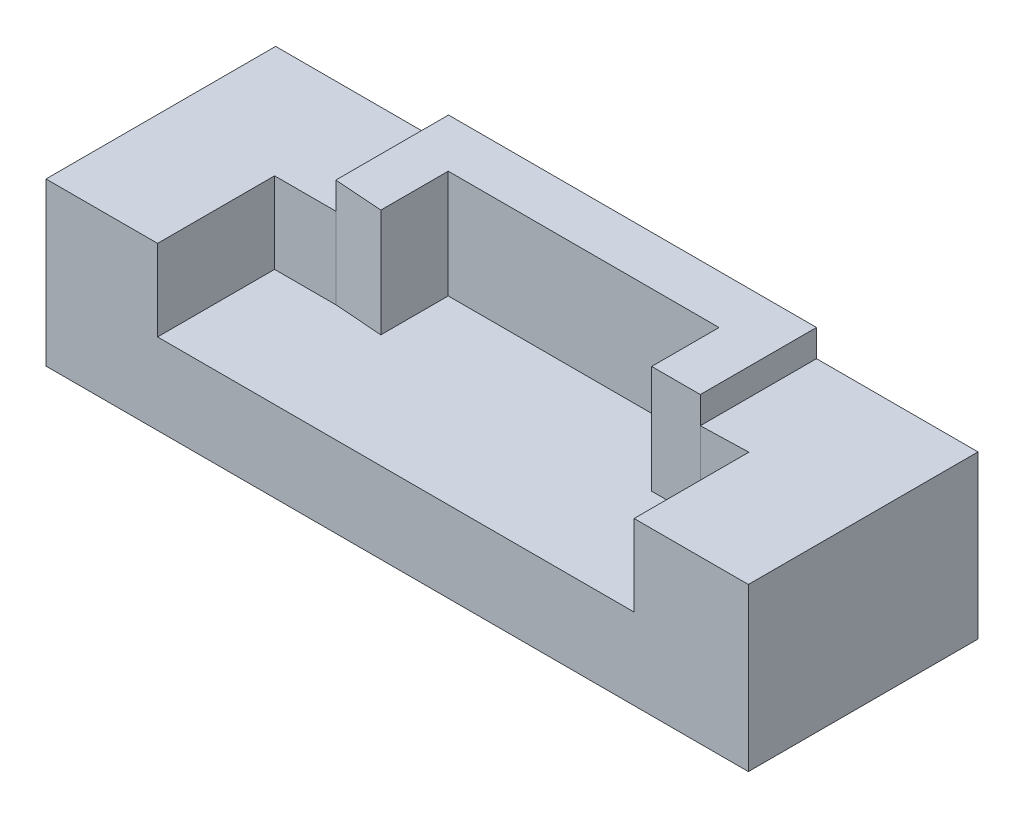
ISO-10303-21;
HEADER;
FILE_DESCRIPTION(('STEP AP214'),'2;1');
FILE_NAME('part.step','',(''),(''),'','','');
FILE_SCHEMA(('AUTOMOTIVE_DESIGN { 1 0 10303 214 1 1 1 1 }'));
ENDSEC;
DATA;
#1=APPLICATION_CONTEXT('core data for automotive mechanical design processes');
#2=APPLICATION_PROTOCOL_DEFINITION('international standard','automotive_design',2000,#1);
#3=PRODUCT_CONTEXT('',#1,'mechanical');
#4=PRODUCT('Part','Part','',(#3));
#5=PRODUCT_RELATED_PRODUCT_CATEGORY('part','',(#4));
#6=PRODUCT_DEFINITION_FORMATION('','',#4);
#7=PRODUCT_DEFINITION_CONTEXT('part definition',#1,'design');
#8=PRODUCT_DEFINITION('design','',#6,#7);
#9=PRODUCT_DEFINITION_SHAPE('','',#8);
#10=(LENGTH_UNIT() NAMED_UNIT(*) SI_UNIT(.MILLI.,.METRE.));
#11=(NAMED_UNIT(*) PLANE_ANGLE_UNIT() SI_UNIT($,.RADIAN.));
#12=(NAMED_UNIT(*) SI_UNIT($,.STERADIAN.) SOLID_ANGLE_UNIT());
#13=UNCERTAINTY_MEASURE_WITH_UNIT(LENGTH_MEASURE(1.E-05),#10,'distance_accuracy_value','');
#14=(GEOMETRIC_REPRESENTATION_CONTEXT(3) GLOBAL_UNCERTAINTY_ASSIGNED_CONTEXT((#13)) GLOBAL_UNIT_ASSIGNED_CONTEXT((#10,
#11,#12)) REPRESENTATION_CONTEXT('',''));
#15=CARTESIAN_POINT('',(0.,0.,0.));
#16=DIRECTION('',(0.,0.,1.));
#17=DIRECTION('',(1.,0.,0.));
#18=AXIS2_PLACEMENT_3D('',#15,#16,#17);
#19=CARTESIAN_POINT('',(0.,6.,0.));
#20=DIRECTION('',(0.,1.,0.));
#21=DIRECTION('',(0.,0.,1.));
#22=AXIS2_PLACEMENT_3D('',#19,#20,#21);
#23=PLANE('',#22);
#24=DIRECTION('',(0.,0.,1.));
#25=VECTOR('',#24,1.);
#26=CARTESIAN_POINT('',(4.36437378753321,6.,5.29710144927536));
#27=LINE('',#26,#25);
#28=CARTESIAN_POINT('',(4.36437378753321,6.,-3.20289855072464));
#29=VERTEX_POINT('',#28);
#30=CARTESIAN_POINT('',(4.36437378753321,6.,5.29710144927536));
#31=VERTEX_POINT('',#30);
#32=EDGE_CURVE('E178',#29,#31,#27,.T.);
#33=ORIENTED_EDGE('',*,*,#32,.F.);
#34=DIRECTION('',(0.999581589508537,0.,-0.0289248321617656));
#35=VECTOR('',#34,1.);
#36=CARTESIAN_POINT('',(4.36437378753321,6.,-3.20289855072464));
#37=LINE('',#36,#35);
#38=CARTESIAN_POINT('',(0.870186747335425,6.,-3.10178747110858));
#39=VERTEX_POINT('',#38);
#40=EDGE_CURVE('E307',#39,#29,#37,.T.);
#41=ORIENTED_EDGE('',*,*,#40,.F.);
#42=DIRECTION('',(-1.,0.,0.));
#43=VECTOR('',#42,1.);
#44=CARTESIAN_POINT('',(0.,6.,-3.10178747110858));
#45=LINE('',#44,#43);
#46=CARTESIAN_POINT('',(-2.73323359372861,6.,-3.10178747110858));
#47=VERTEX_POINT('',#46);
#48=EDGE_CURVE('E187',#39,#47,#45,.T.);
#49=ORIENTED_EDGE('',*,*,#48,.T.);
#50=DIRECTION('',(0.,0.,-1.));
#51=VECTOR('',#50,1.);
#52=CARTESIAN_POINT('',(-2.73323359372861,6.,0.));
#53=LINE('',#52,#51);
#54=CARTESIAN_POINT('',(-2.73323359372861,6.,-8.09113871258186));
#55=VERTEX_POINT('',#54);
#56=EDGE_CURVE('E356',#47,#55,#53,.T.);
#57=ORIENTED_EDGE('',*,*,#56,.T.);
#58=DIRECTION('',(-1.,0.,0.));
#59=VECTOR('',#58,1.);
#60=CARTESIAN_POINT('',(0.,6.,-8.09113871258186));
#61=LINE('',#60,#59);
#62=CARTESIAN_POINT('',(-22.7830339529823,6.,-8.09113871258186));
#63=VERTEX_POINT('',#62);
#64=EDGE_CURVE('E352',#55,#63,#61,.T.);
#65=ORIENTED_EDGE('',*,*,#64,.T.);
#66=DIRECTION('',(0.,0.,1.));
#67=VECTOR('',#66,1.);
#68=CARTESIAN_POINT('',(-22.7830339529823,6.,0.));
#69=LINE('',#68,#67);
#70=CARTESIAN_POINT('',(-22.7830339529823,6.,-3.10178747110858));
#71=VERTEX_POINT('',#70);
#72=EDGE_CURVE('E348',#63,#71,#69,.T.);
#73=ORIENTED_EDGE('',*,*,#72,.T.);
#74=DIRECTION('',(-0.997312768892722,0.,-0.0732614564660877));
#75=VECTOR('',#74,1.);
#76=CARTESIAN_POINT('',(0.104348783423272,6.,-1.42050648658102));
#77=LINE('',#76,#75);
#78=CARTESIAN_POINT('',(-26.3739130434782,6.,-3.36556934613203));
#79=VERTEX_POINT('',#78);
#80=EDGE_CURVE('E189',#71,#79,#77,.T.);
#81=ORIENTED_EDGE('',*,*,#80,.T.);
#82=DIRECTION('',(1.,0.,0.));
#83=VECTOR('',#82,1.);
#84=CARTESIAN_POINT('',(-30.9138285687166,6.,-3.36556934613203));
#85=LINE('',#84,#83);
#86=CARTESIAN_POINT('',(-30.9138285687166,6.,-3.36556934613203));
#87=VERTEX_POINT('',#86);
#88=EDGE_CURVE('E220',#87,#79,#85,.T.);
#89=ORIENTED_EDGE('',*,*,#88,.F.);
#90=DIRECTION('',(0.,0.,-1.));
#91=VECTOR('',#90,1.);
#92=CARTESIAN_POINT('',(-30.9138285687166,6.,5.29710144927536));
#93=LINE('',#92,#91);
#94=CARTESIAN_POINT('',(-30.9138285687166,6.,5.29710144927536));
#95=VERTEX_POINT('',#94);
#96=EDGE_CURVE('E63',#95,#87,#93,.T.);
#97=ORIENTED_EDGE('',*,*,#96,.F.);
#98=DIRECTION('',(1.,0.,0.));
#99=VECTOR('',#98,1.);
#100=CARTESIAN_POINT('',(-39.1739130434782,6.,5.29710144927536));
#101=LINE('',#100,#99);
#102=EDGE_CURVE('E255',#95,#31,#101,.T.);
#103=ORIENTED_EDGE('',*,*,#102,.T.);
#104=EDGE_LOOP('',(#33,#41,#49,#57,#65,#73,#81,#89,#97,#103));
#105=FACE_BOUND('',#104,.T.);
#106=ADVANCED_FACE('F39',(#105),#23,.T.);
#107=CARTESIAN_POINT('',(0.870186747335425,14.,0.));
#108=DIRECTION('',(1.,0.,0.));
#109=DIRECTION('',(0.,0.,-1.));
#110=AXIS2_PLACEMENT_3D('',#107,#108,#109);
#111=PLANE('',#110);
#112=DIRECTION('',(0.,-1.,0.));
#113=VECTOR('',#112,1.);
#114=CARTESIAN_POINT('',(0.870186747335425,14.,-3.10178747110858));
#115=LINE('',#114,#113);
#116=CARTESIAN_POINT('',(0.870186747335425,14.,-3.10178747110858));
#117=VERTEX_POINT('',#116);
#118=CARTESIAN_POINT('',(0.870186747335425,12.,-3.10178747110858));
#119=VERTEX_POINT('',#118);
#120=EDGE_CURVE('E184',#117,#119,#115,.T.);
#121=ORIENTED_EDGE('',*,*,#120,.T.);
#122=DIRECTION('',(0.,0.,1.));
#123=VECTOR('',#122,1.);
#124=CARTESIAN_POINT('',(0.870186747335425,12.,-3.10178747110858));
#125=LINE('',#124,#123);
#126=CARTESIAN_POINT('',(0.870186747335425,12.,-11.7028985507246));
#127=VERTEX_POINT('',#126);
#128=EDGE_CURVE('E171',#127,#119,#125,.T.);
#129=ORIENTED_EDGE('',*,*,#128,.F.);
#130=DIRECTION('',(0.,-1.,0.));
#131=VECTOR('',#130,1.);
#132=CARTESIAN_POINT('',(0.870186747335425,14.,-11.7028985507246));
#133=LINE('',#132,#131);
#134=CARTESIAN_POINT('',(0.870186747335425,14.,-11.7028985507246));
#135=VERTEX_POINT('',#134);
#136=EDGE_CURVE('E197',#135,#127,#133,.T.);
#137=ORIENTED_EDGE('',*,*,#136,.F.);
#138=DIRECTION('',(0.,0.,1.));
#139=VECTOR('',#138,1.);
#140=CARTESIAN_POINT('',(0.870186747335425,14.,0.));
#141=LINE('',#140,#139);
#142=EDGE_CURVE('E194',#135,#117,#141,.T.);
#143=ORIENTED_EDGE('',*,*,#142,.T.);
#144=EDGE_LOOP('',(#121,#129,#137,#143));
#145=FACE_BOUND('',#144,.T.);
#146=ADVANCED_FACE('F192',(#145),#111,.T.);
#147=CARTESIAN_POINT('',(12.8260869565217,6.,-11.7028985507246));
#148=DIRECTION('',(-1.,0.,0.));
#149=DIRECTION('',(0.,0.,1.));
#150=AXIS2_PLACEMENT_3D('',#147,#148,#149);
#151=PLANE('',#150);
#152=DIRECTION('',(0.,0.,-1.));
#153=VECTOR('',#152,1.);
#154=CARTESIAN_POINT('',(12.8260869565217,0.,-11.7028985507246));
#155=LINE('',#154,#153);
#156=CARTESIAN_POINT('',(12.8260869565218,0.,5.29710144927536));
#157=VERTEX_POINT('',#156);
#158=CARTESIAN_POINT('',(12.8260869565217,0.,-11.7028985507246));
#159=VERTEX_POINT('',#158);
#160=EDGE_CURVE('E254',#157,#159,#155,.T.);
#161=ORIENTED_EDGE('',*,*,#160,.T.);
#162=DIRECTION('',(0.,-1.,0.));
#163=VECTOR('',#162,1.);
#164=CARTESIAN_POINT('',(12.8260869565217,6.,-11.7028985507246));
#165=LINE('',#164,#163);
#166=CARTESIAN_POINT('',(12.8260869565217,12.,-11.7028985507246));
#167=VERTEX_POINT('',#166);
#168=EDGE_CURVE('E11',#167,#159,#165,.T.);
#169=ORIENTED_EDGE('',*,*,#168,.F.);
#170=DIRECTION('',(0.,0.,-1.));
#171=VECTOR('',#170,1.);
#172=CARTESIAN_POINT('',(12.8260869565217,12.,-11.7028985507246));
#173=LINE('',#172,#171);
#174=CARTESIAN_POINT('',(12.8260869565218,12.,5.29710144927536));
#175=VERTEX_POINT('',#174);
#176=EDGE_CURVE('E296',#175,#167,#173,.T.);
#177=ORIENTED_EDGE('',*,*,#176,.F.);
#178=DIRECTION('',(0.,-1.,0.));
#179=VECTOR('',#178,1.);
#180=CARTESIAN_POINT('',(12.8260869565218,6.,5.29710144927536));
#181=LINE('',#180,#179);
#182=EDGE_CURVE('E258',#175,#157,#181,.T.);
#183=ORIENTED_EDGE('',*,*,#182,.T.);
#184=EDGE_LOOP('',(#161,#169,#177,#183));
#185=FACE_BOUND('',#184,.T.);
#186=ADVANCED_FACE('F41',(#185),#151,.F.);
#187=CARTESIAN_POINT('',(-39.1739130434782,6.,-11.7028985507246));
#188=DIRECTION('',(0.,0.,1.));
#189=DIRECTION('',(1.,0.,0.));
#190=AXIS2_PLACEMENT_3D('',#187,#188,#189);
#191=PLANE('',#190);
#192=DIRECTION('',(-1.,0.,0.));
#193=VECTOR('',#192,1.);
#194=CARTESIAN_POINT('',(-39.1739130434782,0.,-11.7028985507246));
#195=LINE('',#194,#193);
#196=CARTESIAN_POINT('',(-39.1739130434782,0.,-11.7028985507246));
#197=VERTEX_POINT('',#196);
#198=EDGE_CURVE('E263',#159,#197,#195,.T.);
#199=ORIENTED_EDGE('',*,*,#198,.T.);
#200=DIRECTION('',(0.,-1.,0.));
#201=VECTOR('',#200,1.);
#202=CARTESIAN_POINT('',(-39.1739130434782,6.,-11.7028985507246));
#203=LINE('',#202,#201);
#204=CARTESIAN_POINT('',(-39.1739130434782,12.,-11.7028985507246));
#205=VERTEX_POINT('',#204);
#206=EDGE_CURVE('E48',#205,#197,#203,.T.);
#207=ORIENTED_EDGE('',*,*,#206,.F.);
#208=DIRECTION('',(-1.,0.,0.));
#209=VECTOR('',#208,1.);
#210=CARTESIAN_POINT('',(-39.1739130434782,12.,-11.7028985507246));
#211=LINE('',#210,#209);
#212=CARTESIAN_POINT('',(-26.3739130434782,12.,-11.7028985507246));
#213=VERTEX_POINT('',#212);
#214=EDGE_CURVE('E234',#213,#205,#211,.T.);
#215=ORIENTED_EDGE('',*,*,#214,.F.);
#216=DIRECTION('',(0.,-1.,0.));
#217=VECTOR('',#216,1.);
#218=CARTESIAN_POINT('',(-26.3739130434782,14.,-11.7028985507246));
#219=LINE('',#218,#217);
#220=CARTESIAN_POINT('',(-26.3739130434782,14.,-11.7028985507246));
#221=VERTEX_POINT('',#220);
#222=EDGE_CURVE('E203',#221,#213,#219,.T.);
#223=ORIENTED_EDGE('',*,*,#222,.F.);
#224=DIRECTION('',(-1.,0.,0.));
#225=VECTOR('',#224,1.);
#226=CARTESIAN_POINT('',(0.,14.,-11.7028985507246));
#227=LINE('',#226,#225);
#228=EDGE_CURVE('E338',#135,#221,#227,.T.);
#229=ORIENTED_EDGE('',*,*,#228,.F.);
#230=ORIENTED_EDGE('',*,*,#136,.T.);
#231=DIRECTION('',(-1.,0.,0.));
#232=VECTOR('',#231,1.);
#233=CARTESIAN_POINT('',(0.870186747335425,12.,-11.7028985507246));
#234=LINE('',#233,#232);
#235=EDGE_CURVE('E55',#167,#127,#234,.T.);
#236=ORIENTED_EDGE('',*,*,#235,.F.);
#237=ORIENTED_EDGE('',*,*,#168,.T.);
#238=EDGE_LOOP('',(#199,#207,#215,#223,#229,#230,#236,#237));
#239=FACE_BOUND('',#238,.T.);
#240=ADVANCED_FACE('F375',(#239),#191,.F.);
#241=CARTESIAN_POINT('',(-39.1739130434782,6.,-11.7028985507246));
#242=DIRECTION('',(1.,0.,0.));
#243=DIRECTION('',(0.,0.,-1.));
#244=AXIS2_PLACEMENT_3D('',#241,#242,#243);
#245=PLANE('',#244);
#246=DIRECTION('',(0.,0.,1.));
#247=VECTOR('',#246,1.);
#248=CARTESIAN_POINT('',(-39.1739130434782,0.,-11.7028985507246));
#249=LINE('',#248,#247);
#250=CARTESIAN_POINT('',(-39.1739130434782,0.,5.29710144927536));
#251=VERTEX_POINT('',#250);
#252=EDGE_CURVE('E266',#197,#251,#249,.T.);
#253=ORIENTED_EDGE('',*,*,#252,.T.);
#254=DIRECTION('',(0.,-1.,0.));
#255=VECTOR('',#254,1.);
#256=CARTESIAN_POINT('',(-39.1739130434782,6.,5.29710144927536));
#257=LINE('',#256,#255);
#258=CARTESIAN_POINT('',(-39.1739130434782,12.,5.29710144927537));
#259=VERTEX_POINT('',#258);
#260=EDGE_CURVE('E274',#259,#251,#257,.T.);
#261=ORIENTED_EDGE('',*,*,#260,.F.);
#262=DIRECTION('',(0.,0.,1.));
#263=VECTOR('',#262,1.);
#264=CARTESIAN_POINT('',(-39.1739130434782,12.,-11.7028985507246));
#265=LINE('',#264,#263);
#266=EDGE_CURVE('E215',#205,#259,#265,.T.);
#267=ORIENTED_EDGE('',*,*,#266,.F.);
#268=ORIENTED_EDGE('',*,*,#206,.T.);
#269=EDGE_LOOP('',(#253,#261,#267,#268));
#270=FACE_BOUND('',#269,.T.);
#271=ADVANCED_FACE('F282',(#270),#245,.F.);
#272=CARTESIAN_POINT('',(-39.1739130434782,6.,5.29710144927536));
#273=DIRECTION('',(0.,0.,-1.));
#274=DIRECTION('',(-1.,0.,0.));
#275=AXIS2_PLACEMENT_3D('',#272,#273,#274);
#276=PLANE('',#275);
#277=DIRECTION('',(1.,0.,0.));
#278=VECTOR('',#277,1.);
#279=CARTESIAN_POINT('',(-39.1739130434782,0.,5.29710144927536));
#280=LINE('',#279,#278);
#281=EDGE_CURVE('E259',#251,#157,#280,.T.);
#282=ORIENTED_EDGE('',*,*,#281,.T.);
#283=ORIENTED_EDGE('',*,*,#182,.F.);
#284=DIRECTION('',(1.,0.,0.));
#285=VECTOR('',#284,1.);
#286=CARTESIAN_POINT('',(12.8260869565218,12.,5.29710144927536));
#287=LINE('',#286,#285);
#288=CARTESIAN_POINT('',(4.36437378753321,12.,5.29710144927536));
#289=VERTEX_POINT('',#288);
#290=EDGE_CURVE('E298',#289,#175,#287,.T.);
#291=ORIENTED_EDGE('',*,*,#290,.F.);
#292=DIRECTION('',(0.,-1.,0.));
#293=VECTOR('',#292,1.);
#294=CARTESIAN_POINT('',(4.36437378753321,12.,5.29710144927536));
#295=LINE('',#294,#293);
#296=EDGE_CURVE('E302',#289,#31,#295,.T.);
#297=ORIENTED_EDGE('',*,*,#296,.T.);
#298=ORIENTED_EDGE('',*,*,#102,.F.);
#299=DIRECTION('',(0.,-1.,0.));
#300=VECTOR('',#299,1.);
#301=CARTESIAN_POINT('',(-30.9138285687166,12.,5.29710144927536));
#302=LINE('',#301,#300);
#303=CARTESIAN_POINT('',(-30.9138285687166,12.,5.29710144927536));
#304=VERTEX_POINT('',#303);
#305=EDGE_CURVE('E250',#304,#95,#302,.T.);
#306=ORIENTED_EDGE('',*,*,#305,.F.);
#307=DIRECTION('',(1.,0.,0.));
#308=VECTOR('',#307,1.);
#309=CARTESIAN_POINT('',(-39.1739130434782,12.,5.29710144927537));
#310=LINE('',#309,#308);
#311=EDGE_CURVE('E219',#259,#304,#310,.T.);
#312=ORIENTED_EDGE('',*,*,#311,.F.);
#313=ORIENTED_EDGE('',*,*,#260,.T.);
#314=EDGE_LOOP('',(#282,#283,#291,#297,#298,#306,#312,#313));
#315=FACE_BOUND('',#314,.T.);
#316=ADVANCED_FACE('F290',(#315),#276,.F.);
#317=CARTESIAN_POINT('',(0.,0.,0.));
#318=DIRECTION('',(0.,1.,0.));
#319=DIRECTION('',(0.,0.,1.));
#320=AXIS2_PLACEMENT_3D('',#317,#318,#319);
#321=PLANE('',#320);
#322=ORIENTED_EDGE('',*,*,#160,.F.);
#323=ORIENTED_EDGE('',*,*,#281,.F.);
#324=ORIENTED_EDGE('',*,*,#252,.F.);
#325=ORIENTED_EDGE('',*,*,#198,.F.);
#326=EDGE_LOOP('',(#322,#323,#324,#325));
#327=FACE_BOUND('',#326,.T.);
#328=ADVANCED_FACE('F288',(#327),#321,.F.);
#329=CARTESIAN_POINT('',(-30.9138285687166,12.,5.29710144927536));
#330=DIRECTION('',(-1.,0.,0.));
#331=DIRECTION('',(0.,0.,1.));
#332=AXIS2_PLACEMENT_3D('',#329,#330,#331);
#333=PLANE('',#332);
#334=ORIENTED_EDGE('',*,*,#96,.T.);
#335=DIRECTION('',(0.,-1.,0.));
#336=VECTOR('',#335,1.);
#337=CARTESIAN_POINT('',(-30.9138285687166,12.,-3.36556934613203));
#338=LINE('',#337,#336);
#339=CARTESIAN_POINT('',(-30.9138285687166,12.,-3.36556934613203));
#340=VERTEX_POINT('',#339);
#341=EDGE_CURVE('E246',#340,#87,#338,.T.);
#342=ORIENTED_EDGE('',*,*,#341,.F.);
#343=DIRECTION('',(0.,0.,-1.));
#344=VECTOR('',#343,1.);
#345=CARTESIAN_POINT('',(-30.9138285687166,12.,5.29710144927536));
#346=LINE('',#345,#344);
#347=EDGE_CURVE('E223',#304,#340,#346,.T.);
#348=ORIENTED_EDGE('',*,*,#347,.F.);
#349=ORIENTED_EDGE('',*,*,#305,.T.);
#350=EDGE_LOOP('',(#334,#342,#348,#349));
#351=FACE_BOUND('',#350,.T.);
#352=ADVANCED_FACE('F391',(#351),#333,.F.);
#353=CARTESIAN_POINT('',(-30.9138285687166,12.,-3.36556934613203));
#354=DIRECTION('',(0.,0.,-1.));
#355=DIRECTION('',(-1.,0.,0.));
#356=AXIS2_PLACEMENT_3D('',#353,#354,#355);
#357=PLANE('',#356);
#358=ORIENTED_EDGE('',*,*,#88,.T.);
#359=DIRECTION('',(0.,-1.,0.));
#360=VECTOR('',#359,1.);
#361=CARTESIAN_POINT('',(-26.3739130434782,12.,-3.36556934613203));
#362=LINE('',#361,#360);
#363=CARTESIAN_POINT('',(-26.3739130434782,12.,-3.36556934613203));
#364=VERTEX_POINT('',#363);
#365=EDGE_CURVE('E238',#364,#79,#362,.T.);
#366=ORIENTED_EDGE('',*,*,#365,.F.);
#367=DIRECTION('',(1.,0.,0.));
#368=VECTOR('',#367,1.);
#369=CARTESIAN_POINT('',(-30.9138285687166,12.,-3.36556934613203));
#370=LINE('',#369,#368);
#371=EDGE_CURVE('E226',#340,#364,#370,.T.);
#372=ORIENTED_EDGE('',*,*,#371,.F.);
#373=ORIENTED_EDGE('',*,*,#341,.T.);
#374=EDGE_LOOP('',(#358,#366,#372,#373));
#375=FACE_BOUND('',#374,.T.);
#376=ADVANCED_FACE('F411',(#375),#357,.F.);
#377=CARTESIAN_POINT('',(0.,12.,0.));
#378=DIRECTION('',(0.,1.,0.));
#379=DIRECTION('',(0.,0.,1.));
#380=AXIS2_PLACEMENT_3D('',#377,#378,#379);
#381=PLANE('',#380);
#382=ORIENTED_EDGE('',*,*,#266,.T.);
#383=ORIENTED_EDGE('',*,*,#311,.T.);
#384=ORIENTED_EDGE('',*,*,#347,.T.);
#385=ORIENTED_EDGE('',*,*,#371,.T.);
#386=DIRECTION('',(0.,0.,-1.));
#387=VECTOR('',#386,1.);
#388=CARTESIAN_POINT('',(-26.3739130434782,12.,-3.36556934613203));
#389=LINE('',#388,#387);
#390=EDGE_CURVE('E230',#364,#213,#389,.T.);
#391=ORIENTED_EDGE('',*,*,#390,.T.);
#392=ORIENTED_EDGE('',*,*,#214,.T.);
#393=EDGE_LOOP('',(#382,#383,#384,#385,#391,#392));
#394=FACE_BOUND('',#393,.T.);
#395=ADVANCED_FACE('F372',(#394),#381,.T.);
#396=CARTESIAN_POINT('',(0.104348783423272,14.,-1.42050648658102));
#397=DIRECTION('',(-0.0732614564660877,0.,0.997312768892722));
#398=DIRECTION('',(0.997312768892722,0.,0.0732614564660877));
#399=AXIS2_PLACEMENT_3D('',#396,#397,#398);
#400=PLANE('',#399);
#401=ORIENTED_EDGE('',*,*,#80,.F.);
#402=DIRECTION('',(0.,-1.,0.));
#403=VECTOR('',#402,1.);
#404=CARTESIAN_POINT('',(-22.7830339529823,14.,-3.10178747110858));
#405=LINE('',#404,#403);
#406=CARTESIAN_POINT('',(-22.7830339529823,14.,-3.10178747110858));
#407=VERTEX_POINT('',#406);
#408=EDGE_CURVE('E212',#407,#71,#405,.T.);
#409=ORIENTED_EDGE('',*,*,#408,.F.);
#410=DIRECTION('',(-0.997312768892722,0.,-0.0732614564660877));
#411=VECTOR('',#410,1.);
#412=CARTESIAN_POINT('',(0.104348783423272,14.,-1.42050648658102));
#413=LINE('',#412,#411);
#414=CARTESIAN_POINT('',(-26.3739130434782,14.,-3.36556934613203));
#415=VERTEX_POINT('',#414);
#416=EDGE_CURVE('E317',#407,#415,#413,.T.);
#417=ORIENTED_EDGE('',*,*,#416,.T.);
#418=DIRECTION('',(0.,-1.,0.));
#419=VECTOR('',#418,1.);
#420=CARTESIAN_POINT('',(-26.3739130434782,14.,-3.36556934613203));
#421=LINE('',#420,#419);
#422=EDGE_CURVE('E344',#415,#364,#421,.T.);
#423=ORIENTED_EDGE('',*,*,#422,.T.);
#424=ORIENTED_EDGE('',*,*,#365,.T.);
#425=EDGE_LOOP('',(#401,#409,#417,#423,#424));
#426=FACE_BOUND('',#425,.T.);
#427=ADVANCED_FACE('F424',(#426),#400,.T.);
#428=CARTESIAN_POINT('',(-22.7830339529823,14.,0.));
#429=DIRECTION('',(1.,0.,0.));
#430=DIRECTION('',(0.,0.,-1.));
#431=AXIS2_PLACEMENT_3D('',#428,#429,#430);
#432=PLANE('',#431);
#433=ORIENTED_EDGE('',*,*,#72,.F.);
#434=DIRECTION('',(0.,-1.,0.));
#435=VECTOR('',#434,1.);
#436=CARTESIAN_POINT('',(-22.7830339529823,14.,-8.09113871258186));
#437=LINE('',#436,#435);
#438=CARTESIAN_POINT('',(-22.7830339529823,14.,-8.09113871258186));
#439=VERTEX_POINT('',#438);
#440=EDGE_CURVE('E209',#439,#63,#437,.T.);
#441=ORIENTED_EDGE('',*,*,#440,.F.);
#442=DIRECTION('',(0.,0.,1.));
#443=VECTOR('',#442,1.);
#444=CARTESIAN_POINT('',(-22.7830339529823,14.,0.));
#445=LINE('',#444,#443);
#446=EDGE_CURVE('E321',#439,#407,#445,.T.);
#447=ORIENTED_EDGE('',*,*,#446,.T.);
#448=ORIENTED_EDGE('',*,*,#408,.T.);
#449=EDGE_LOOP('',(#433,#441,#447,#448));
#450=FACE_BOUND('',#449,.T.);
#451=ADVANCED_FACE('F431',(#450),#432,.T.);
#452=CARTESIAN_POINT('',(0.,14.,-8.09113871258186));
#453=DIRECTION('',(0.,0.,1.));
#454=DIRECTION('',(1.,0.,0.));
#455=AXIS2_PLACEMENT_3D('',#452,#453,#454);
#456=PLANE('',#455);
#457=ORIENTED_EDGE('',*,*,#64,.F.);
#458=DIRECTION('',(0.,-1.,0.));
#459=VECTOR('',#458,1.);
#460=CARTESIAN_POINT('',(-2.73323359372861,14.,-8.09113871258186));
#461=LINE('',#460,#459);
#462=CARTESIAN_POINT('',(-2.73323359372861,14.,-8.09113871258186));
#463=VERTEX_POINT('',#462);
#464=EDGE_CURVE('E201',#463,#55,#461,.T.);
#465=ORIENTED_EDGE('',*,*,#464,.F.);
#466=DIRECTION('',(-1.,0.,0.));
#467=VECTOR('',#466,1.);
#468=CARTESIAN_POINT('',(0.,14.,-8.09113871258186));
#469=LINE('',#468,#467);
#470=EDGE_CURVE('E325',#463,#439,#469,.T.);
#471=ORIENTED_EDGE('',*,*,#470,.T.);
#472=ORIENTED_EDGE('',*,*,#440,.T.);
#473=EDGE_LOOP('',(#457,#465,#471,#472));
#474=FACE_BOUND('',#473,.T.);
#475=ADVANCED_FACE('F439',(#474),#456,.T.);
#476=CARTESIAN_POINT('',(-2.73323359372861,14.,0.));
#477=DIRECTION('',(-1.,0.,0.));
#478=DIRECTION('',(0.,0.,1.));
#479=AXIS2_PLACEMENT_3D('',#476,#477,#478);
#480=PLANE('',#479);
#481=ORIENTED_EDGE('',*,*,#56,.F.);
#482=DIRECTION('',(0.,-1.,0.));
#483=VECTOR('',#482,1.);
#484=CARTESIAN_POINT('',(-2.73323359372861,14.,-3.10178747110858));
#485=LINE('',#484,#483);
#486=CARTESIAN_POINT('',(-2.73323359372861,14.,-3.10178747110858));
#487=VERTEX_POINT('',#486);
#488=EDGE_CURVE('E196',#487,#47,#485,.T.);
#489=ORIENTED_EDGE('',*,*,#488,.F.);
#490=DIRECTION('',(0.,0.,-1.));
#491=VECTOR('',#490,1.);
#492=CARTESIAN_POINT('',(-2.73323359372861,14.,0.));
#493=LINE('',#492,#491);
#494=EDGE_CURVE('E329',#487,#463,#493,.T.);
#495=ORIENTED_EDGE('',*,*,#494,.T.);
#496=ORIENTED_EDGE('',*,*,#464,.T.);
#497=EDGE_LOOP('',(#481,#489,#495,#496));
#498=FACE_BOUND('',#497,.T.);
#499=ADVANCED_FACE('F447',(#498),#480,.T.);
#500=CARTESIAN_POINT('',(0.,14.,-3.10178747110858));
#501=DIRECTION('',(0.,0.,1.));
#502=DIRECTION('',(1.,0.,0.));
#503=AXIS2_PLACEMENT_3D('',#500,#501,#502);
#504=PLANE('',#503);
#505=ORIENTED_EDGE('',*,*,#48,.F.);
#506=DIRECTION('',(0.,-1.,0.));
#507=VECTOR('',#506,1.);
#508=CARTESIAN_POINT('',(0.870186747335425,12.,-3.10178747110858));
#509=LINE('',#508,#507);
#510=EDGE_CURVE('E164',#119,#39,#509,.T.);
#511=ORIENTED_EDGE('',*,*,#510,.F.);
#512=ORIENTED_EDGE('',*,*,#120,.F.);
#513=DIRECTION('',(-1.,0.,0.));
#514=VECTOR('',#513,1.);
#515=CARTESIAN_POINT('',(0.,14.,-3.10178747110858));
#516=LINE('',#515,#514);
#517=EDGE_CURVE('E333',#117,#487,#516,.T.);
#518=ORIENTED_EDGE('',*,*,#517,.T.);
#519=ORIENTED_EDGE('',*,*,#488,.T.);
#520=EDGE_LOOP('',(#505,#511,#512,#518,#519));
#521=FACE_BOUND('',#520,.T.);
#522=ADVANCED_FACE('F182',(#521),#504,.T.);
#523=CARTESIAN_POINT('',(-26.3739130434782,14.,0.));
#524=DIRECTION('',(1.,0.,0.));
#525=DIRECTION('',(0.,0.,-1.));
#526=AXIS2_PLACEMENT_3D('',#523,#524,#525);
#527=PLANE('',#526);
#528=ORIENTED_EDGE('',*,*,#390,.F.);
#529=ORIENTED_EDGE('',*,*,#422,.F.);
#530=DIRECTION('',(0.,0.,1.));
#531=VECTOR('',#530,1.);
#532=CARTESIAN_POINT('',(-26.3739130434782,14.,0.));
#533=LINE('',#532,#531);
#534=EDGE_CURVE('E341',#221,#415,#533,.T.);
#535=ORIENTED_EDGE('',*,*,#534,.F.);
#536=ORIENTED_EDGE('',*,*,#222,.T.);
#537=EDGE_LOOP('',(#528,#529,#535,#536));
#538=FACE_BOUND('',#537,.T.);
#539=ADVANCED_FACE('F368',(#538),#527,.F.);
#540=CARTESIAN_POINT('',(0.,14.,0.));
#541=DIRECTION('',(0.,1.,0.));
#542=DIRECTION('',(0.,0.,1.));
#543=AXIS2_PLACEMENT_3D('',#540,#541,#542);
#544=PLANE('',#543);
#545=ORIENTED_EDGE('',*,*,#416,.F.);
#546=ORIENTED_EDGE('',*,*,#446,.F.);
#547=ORIENTED_EDGE('',*,*,#470,.F.);
#548=ORIENTED_EDGE('',*,*,#494,.F.);
#549=ORIENTED_EDGE('',*,*,#517,.F.);
#550=ORIENTED_EDGE('',*,*,#142,.F.);
#551=ORIENTED_EDGE('',*,*,#228,.T.);
#552=ORIENTED_EDGE('',*,*,#534,.T.);
#553=EDGE_LOOP('',(#545,#546,#547,#548,#549,#550,#551,#552));
#554=FACE_BOUND('',#553,.T.);
#555=ADVANCED_FACE('F468',(#554),#544,.T.);
#556=CARTESIAN_POINT('',(4.36437378753321,12.,-3.20289855072464));
#557=DIRECTION('',(-0.0289248321617656,0.,-0.999581589508537));
#558=DIRECTION('',(-0.999581589508537,0.,0.0289248321617657));
#559=AXIS2_PLACEMENT_3D('',#556,#557,#558);
#560=PLANE('',#559);
#561=ORIENTED_EDGE('',*,*,#40,.T.);
#562=DIRECTION('',(0.,-1.,0.));
#563=VECTOR('',#562,1.);
#564=CARTESIAN_POINT('',(4.36437378753321,12.,-3.20289855072464));
#565=LINE('',#564,#563);
#566=CARTESIAN_POINT('',(4.36437378753321,12.,-3.20289855072464));
#567=VERTEX_POINT('',#566);
#568=EDGE_CURVE('E167',#567,#29,#565,.T.);
#569=ORIENTED_EDGE('',*,*,#568,.F.);
#570=DIRECTION('',(0.999581589508537,0.,-0.0289248321617656));
#571=VECTOR('',#570,1.);
#572=CARTESIAN_POINT('',(4.36437378753321,12.,-3.20289855072464));
#573=LINE('',#572,#571);
#574=EDGE_CURVE('E161',#119,#567,#573,.T.);
#575=ORIENTED_EDGE('',*,*,#574,.F.);
#576=ORIENTED_EDGE('',*,*,#510,.T.);
#577=EDGE_LOOP('',(#561,#569,#575,#576));
#578=FACE_BOUND('',#577,.T.);
#579=ADVANCED_FACE('F162',(#578),#560,.F.);
#580=CARTESIAN_POINT('',(4.36437378753321,12.,5.29710144927536));
#581=DIRECTION('',(1.,0.,0.));
#582=DIRECTION('',(0.,0.,-1.));
#583=AXIS2_PLACEMENT_3D('',#580,#581,#582);
#584=PLANE('',#583);
#585=ORIENTED_EDGE('',*,*,#32,.T.);
#586=ORIENTED_EDGE('',*,*,#296,.F.);
#587=DIRECTION('',(0.,0.,1.));
#588=VECTOR('',#587,1.);
#589=CARTESIAN_POINT('',(4.36437378753321,12.,5.29710144927536));
#590=LINE('',#589,#588);
#591=EDGE_CURVE('E170',#567,#289,#590,.T.);
#592=ORIENTED_EDGE('',*,*,#591,.F.);
#593=ORIENTED_EDGE('',*,*,#568,.T.);
#594=EDGE_LOOP('',(#585,#586,#592,#593));
#595=FACE_BOUND('',#594,.T.);
#596=ADVANCED_FACE('F481',(#595),#584,.F.);
#597=CARTESIAN_POINT('',(0.,12.,0.));
#598=DIRECTION('',(0.,-1.,0.));
#599=DIRECTION('',(0.,0.,-1.));
#600=AXIS2_PLACEMENT_3D('',#597,#598,#599);
#601=PLANE('',#600);
#602=ORIENTED_EDGE('',*,*,#128,.T.);
#603=ORIENTED_EDGE('',*,*,#574,.T.);
#604=ORIENTED_EDGE('',*,*,#591,.T.);
#605=ORIENTED_EDGE('',*,*,#290,.T.);
#606=ORIENTED_EDGE('',*,*,#176,.T.);
#607=ORIENTED_EDGE('',*,*,#235,.T.);
#608=EDGE_LOOP('',(#602,#603,#604,#605,#606,#607));
#609=FACE_BOUND('',#608,.T.);
#610=ADVANCED_FACE('F173',(#609),#601,.F.);
#611=CLOSED_SHELL('',(#106,#146,#186,#240,#271,#316,#328,#352,#376,#395,#427,#451,#475,#499,
#522,#539,#555,#579,#596,#610));
#612=MANIFOLD_SOLID_BREP('B2',#611);
#613=ADVANCED_BREP_SHAPE_REPRESENTATION('',(#18,#612),#14);
#614=SHAPE_DEFINITION_REPRESENTATION(#9,#613);
ENDSEC;
END-ISO-10303-21;
